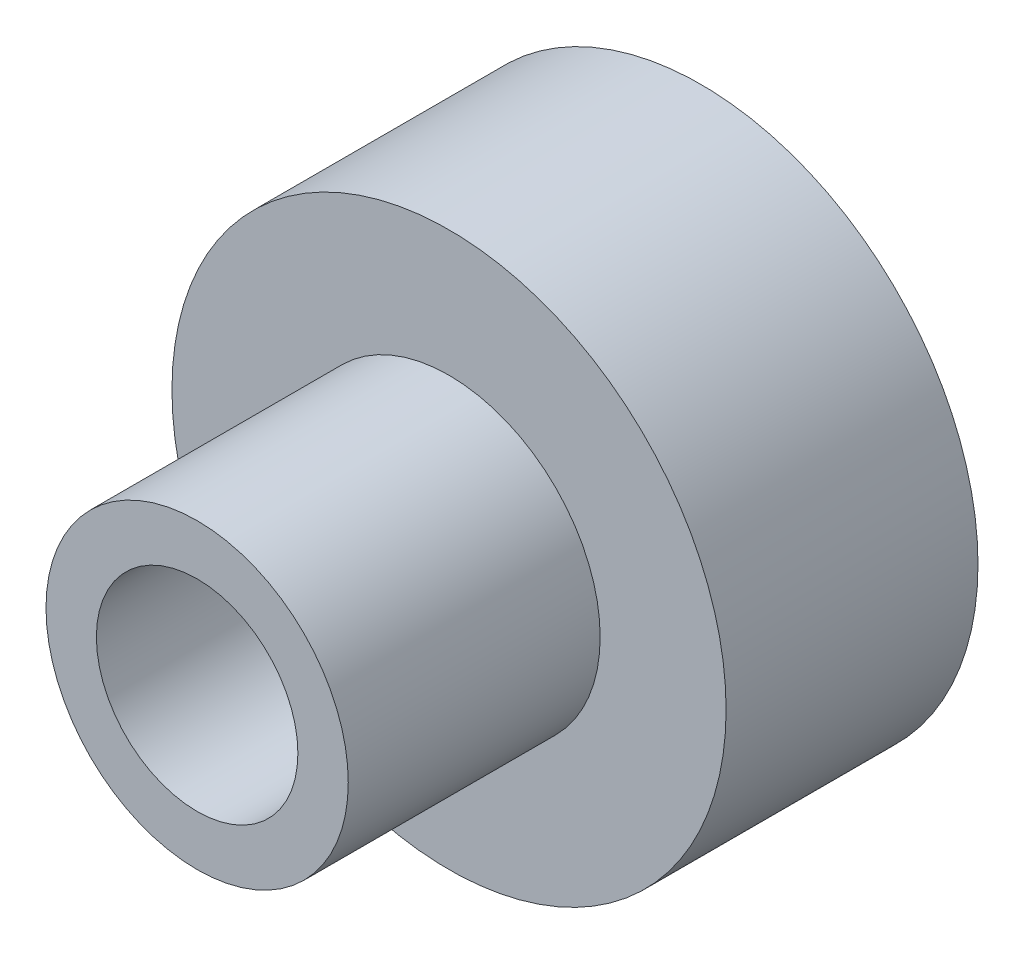
ISO-10303-21;
HEADER;
FILE_DESCRIPTION(('STEP AP214'),'2;1');
FILE_NAME('part.step','',(''),(''),'','','');
FILE_SCHEMA(('AUTOMOTIVE_DESIGN { 1 0 10303 214 1 1 1 1 }'));
ENDSEC;
DATA;
#1=APPLICATION_CONTEXT('core data for automotive mechanical design processes');
#2=APPLICATION_PROTOCOL_DEFINITION('international standard','automotive_design',2000,#1);
#3=PRODUCT_CONTEXT('',#1,'mechanical');
#4=PRODUCT('Part','Part','',(#3));
#5=PRODUCT_RELATED_PRODUCT_CATEGORY('part','',(#4));
#6=PRODUCT_DEFINITION_FORMATION('','',#4);
#7=PRODUCT_DEFINITION_CONTEXT('part definition',#1,'design');
#8=PRODUCT_DEFINITION('design','',#6,#7);
#9=PRODUCT_DEFINITION_SHAPE('','',#8);
#10=(LENGTH_UNIT() NAMED_UNIT(*) SI_UNIT(.MILLI.,.METRE.));
#11=(NAMED_UNIT(*) PLANE_ANGLE_UNIT() SI_UNIT($,.RADIAN.));
#12=(NAMED_UNIT(*) SI_UNIT($,.STERADIAN.) SOLID_ANGLE_UNIT());
#13=UNCERTAINTY_MEASURE_WITH_UNIT(LENGTH_MEASURE(1.E-05),#10,'distance_accuracy_value','');
#14=(GEOMETRIC_REPRESENTATION_CONTEXT(3) GLOBAL_UNCERTAINTY_ASSIGNED_CONTEXT((#13)) GLOBAL_UNIT_ASSIGNED_CONTEXT((#10,
#11,#12)) REPRESENTATION_CONTEXT('',''));
#15=CARTESIAN_POINT('',(0.,0.,0.));
#16=DIRECTION('',(0.,0.,1.));
#17=DIRECTION('',(1.,0.,0.));
#18=AXIS2_PLACEMENT_3D('',#15,#16,#17);
#19=CARTESIAN_POINT('',(0.,0.,-50.));
#20=DIRECTION('',(0.,0.,1.));
#21=DIRECTION('',(1.,0.,0.));
#22=AXIS2_PLACEMENT_3D('',#19,#20,#21);
#23=CYLINDRICAL_SURFACE('',#22,30.);
#24=CARTESIAN_POINT('',(0.,0.,0.));
#25=DIRECTION('',(0.,0.,1.));
#26=DIRECTION('',(1.,0.,0.));
#27=AXIS2_PLACEMENT_3D('',#24,#25,#26);
#28=CIRCLE('',#27,30.);
#29=CARTESIAN_POINT('',(30.,0.,0.));
#30=VERTEX_POINT('',#29);
#31=EDGE_CURVE('E58',#30,#30,#28,.T.);
#32=ORIENTED_EDGE('',*,*,#31,.T.);
#33=EDGE_LOOP('',(#32));
#34=FACE_BOUND('',#33,.T.);
#35=CARTESIAN_POINT('',(0.,0.,-10.));
#36=DIRECTION('',(0.,0.,-1.));
#37=DIRECTION('',(-1.,0.,0.));
#38=AXIS2_PLACEMENT_3D('',#35,#36,#37);
#39=CIRCLE('',#38,30.);
#40=CARTESIAN_POINT('',(-30.,0.,-10.));
#41=VERTEX_POINT('',#40);
#42=EDGE_CURVE('E53',#41,#41,#39,.F.);
#43=ORIENTED_EDGE('',*,*,#42,.F.);
#44=EDGE_LOOP('',(#43));
#45=FACE_BOUND('',#44,.T.);
#46=ADVANCED_FACE('F49',(#34,#45),#23,.F.);
#47=CARTESIAN_POINT('',(0.,0.,-50.));
#48=DIRECTION('',(0.,0.,1.));
#49=DIRECTION('',(1.,0.,0.));
#50=AXIS2_PLACEMENT_3D('',#47,#48,#49);
#51=CYLINDRICAL_SURFACE('',#50,55.);
#52=CARTESIAN_POINT('',(0.,0.,-50.));
#53=DIRECTION('',(0.,0.,1.));
#54=DIRECTION('',(1.,0.,0.));
#55=AXIS2_PLACEMENT_3D('',#52,#53,#54);
#56=CIRCLE('',#55,55.);
#57=CARTESIAN_POINT('',(55.,0.,-50.));
#58=VERTEX_POINT('',#57);
#59=EDGE_CURVE('E11',#58,#58,#56,.T.);
#60=ORIENTED_EDGE('',*,*,#59,.T.);
#61=EDGE_LOOP('',(#60));
#62=FACE_BOUND('',#61,.T.);
#63=CARTESIAN_POINT('',(0.,0.,0.));
#64=DIRECTION('',(0.,0.,1.));
#65=DIRECTION('',(1.,0.,0.));
#66=AXIS2_PLACEMENT_3D('',#63,#64,#65);
#67=CIRCLE('',#66,55.);
#68=CARTESIAN_POINT('',(55.,0.,0.));
#69=VERTEX_POINT('',#68);
#70=EDGE_CURVE('E64',#69,#69,#67,.T.);
#71=ORIENTED_EDGE('',*,*,#70,.F.);
#72=EDGE_LOOP('',(#71));
#73=FACE_BOUND('',#72,.T.);
#74=ADVANCED_FACE('F51',(#62,#73),#51,.T.);
#75=CARTESIAN_POINT('',(0.,0.,-50.));
#76=DIRECTION('',(0.,0.,1.));
#77=DIRECTION('',(1.,0.,0.));
#78=AXIS2_PLACEMENT_3D('',#75,#76,#77);
#79=PLANE('',#78);
#80=CARTESIAN_POINT('',(0.,0.,-50.));
#81=DIRECTION('',(0.,0.,-1.));
#82=DIRECTION('',(-1.,0.,0.));
#83=AXIS2_PLACEMENT_3D('',#80,#81,#82);
#84=CIRCLE('',#83,42.5);
#85=CARTESIAN_POINT('',(-42.5,0.,-50.));
#86=VERTEX_POINT('',#85);
#87=EDGE_CURVE('E67',#86,#86,#84,.T.);
#88=ORIENTED_EDGE('',*,*,#87,.F.);
#89=EDGE_LOOP('',(#88));
#90=FACE_BOUND('',#89,.T.);
#91=ORIENTED_EDGE('',*,*,#59,.F.);
#92=EDGE_LOOP('',(#91));
#93=FACE_BOUND('',#92,.T.);
#94=ADVANCED_FACE('F88',(#90,#93),#79,.F.);
#95=CARTESIAN_POINT('',(0.,0.,0.));
#96=DIRECTION('',(0.,0.,1.));
#97=DIRECTION('',(1.,0.,0.));
#98=AXIS2_PLACEMENT_3D('',#95,#96,#97);
#99=PLANE('',#98);
#100=ORIENTED_EDGE('',*,*,#70,.T.);
#101=EDGE_LOOP('',(#100));
#102=FACE_BOUND('',#101,.T.);
#103=ORIENTED_EDGE('',*,*,#31,.F.);
#104=EDGE_LOOP('',(#103));
#105=FACE_BOUND('',#104,.T.);
#106=ADVANCED_FACE('F91',(#102,#105),#99,.T.);
#107=CARTESIAN_POINT('',(0.,0.,-10.));
#108=DIRECTION('',(0.,0.,-1.));
#109=DIRECTION('',(-1.,0.,0.));
#110=AXIS2_PLACEMENT_3D('',#107,#108,#109);
#111=PLANE('',#110);
#112=CARTESIAN_POINT('',(0.,0.,-10.));
#113=DIRECTION('',(0.,0.,-1.));
#114=DIRECTION('',(-1.,0.,0.));
#115=AXIS2_PLACEMENT_3D('',#112,#113,#114);
#116=CIRCLE('',#115,42.5);
#117=CARTESIAN_POINT('',(-42.5,0.,-10.));
#118=VERTEX_POINT('',#117);
#119=EDGE_CURVE('E75',#118,#118,#116,.T.);
#120=ORIENTED_EDGE('',*,*,#119,.T.);
#121=EDGE_LOOP('',(#120));
#122=FACE_BOUND('',#121,.T.);
#123=ORIENTED_EDGE('',*,*,#42,.T.);
#124=EDGE_LOOP('',(#123));
#125=FACE_BOUND('',#124,.T.);
#126=ADVANCED_FACE('F97',(#122,#125),#111,.T.);
#127=CARTESIAN_POINT('',(0.,0.,-10.));
#128=DIRECTION('',(0.,0.,-1.));
#129=DIRECTION('',(-1.,0.,0.));
#130=AXIS2_PLACEMENT_3D('',#127,#128,#129);
#131=CYLINDRICAL_SURFACE('',#130,42.5);
#132=ORIENTED_EDGE('',*,*,#119,.F.);
#133=EDGE_LOOP('',(#132));
#134=FACE_BOUND('',#133,.T.);
#135=ORIENTED_EDGE('',*,*,#87,.T.);
#136=EDGE_LOOP('',(#135));
#137=FACE_BOUND('',#136,.T.);
#138=ADVANCED_FACE('F86',(#134,#137),#131,.F.);
#139=CLOSED_SHELL('',(#46,#74,#94,#106,#126,#138));
#140=MANIFOLD_SOLID_BREP('B2',#139);
#141=CARTESIAN_POINT('',(0.,0.,50.));
#142=DIRECTION('',(0.,0.,-1.));
#143=DIRECTION('',(-1.,0.,0.));
#144=AXIS2_PLACEMENT_3D('',#141,#142,#143);
#145=CYLINDRICAL_SURFACE('',#144,30.);
#146=CARTESIAN_POINT('',(0.,0.,50.));
#147=DIRECTION('',(0.,0.,1.));
#148=DIRECTION('',(1.,0.,0.));
#149=AXIS2_PLACEMENT_3D('',#146,#147,#148);
#150=CIRCLE('',#149,30.);
#151=CARTESIAN_POINT('',(30.,0.,50.));
#152=VERTEX_POINT('',#151);
#153=EDGE_CURVE('E48',#152,#152,#150,.T.);
#154=ORIENTED_EDGE('',*,*,#153,.F.);
#155=EDGE_LOOP('',(#154));
#156=FACE_BOUND('',#155,.T.);
#157=CARTESIAN_POINT('',(0.,0.,0.));
#158=DIRECTION('',(0.,0.,1.));
#159=DIRECTION('',(1.,0.,0.));
#160=AXIS2_PLACEMENT_3D('',#157,#158,#159);
#161=CIRCLE('',#160,30.);
#162=CARTESIAN_POINT('',(30.,0.,0.));
#163=VERTEX_POINT('',#162);
#164=EDGE_CURVE('E172',#163,#163,#161,.T.);
#165=ORIENTED_EDGE('',*,*,#164,.T.);
#166=EDGE_LOOP('',(#165));
#167=FACE_BOUND('',#166,.T.);
#168=ADVANCED_FACE('F165',(#156,#167),#145,.T.);
#169=CARTESIAN_POINT('',(0.,0.,50.));
#170=DIRECTION('',(0.,0.,1.));
#171=DIRECTION('',(1.,0.,0.));
#172=AXIS2_PLACEMENT_3D('',#169,#170,#171);
#173=PLANE('',#172);
#174=CARTESIAN_POINT('',(0.,0.,50.));
#175=DIRECTION('',(0.,0.,1.));
#176=DIRECTION('',(1.,0.,0.));
#177=AXIS2_PLACEMENT_3D('',#174,#175,#176);
#178=CIRCLE('',#177,20.);
#179=CARTESIAN_POINT('',(20.,0.,50.));
#180=VERTEX_POINT('',#179);
#181=EDGE_CURVE('E178',#180,#180,#178,.T.);
#182=ORIENTED_EDGE('',*,*,#181,.F.);
#183=EDGE_LOOP('',(#182));
#184=FACE_BOUND('',#183,.T.);
#185=ORIENTED_EDGE('',*,*,#153,.T.);
#186=EDGE_LOOP('',(#185));
#187=FACE_BOUND('',#186,.T.);
#188=ADVANCED_FACE('F194',(#184,#187),#173,.T.);
#189=CARTESIAN_POINT('',(0.,0.,0.));
#190=DIRECTION('',(0.,0.,1.));
#191=DIRECTION('',(1.,0.,0.));
#192=AXIS2_PLACEMENT_3D('',#189,#190,#191);
#193=PLANE('',#192);
#194=CARTESIAN_POINT('',(0.,0.,0.));
#195=DIRECTION('',(0.,0.,1.));
#196=DIRECTION('',(1.,0.,0.));
#197=AXIS2_PLACEMENT_3D('',#194,#195,#196);
#198=CIRCLE('',#197,20.);
#199=CARTESIAN_POINT('',(20.,0.,0.));
#200=VERTEX_POINT('',#199);
#201=EDGE_CURVE('E168',#200,#200,#198,.T.);
#202=ORIENTED_EDGE('',*,*,#201,.T.);
#203=EDGE_LOOP('',(#202));
#204=FACE_BOUND('',#203,.T.);
#205=ORIENTED_EDGE('',*,*,#164,.F.);
#206=EDGE_LOOP('',(#205));
#207=FACE_BOUND('',#206,.T.);
#208=ADVANCED_FACE('F185',(#204,#207),#193,.F.);
#209=CARTESIAN_POINT('',(0.,0.,-50.));
#210=DIRECTION('',(0.,0.,1.));
#211=DIRECTION('',(1.,0.,0.));
#212=AXIS2_PLACEMENT_3D('',#209,#210,#211);
#213=CYLINDRICAL_SURFACE('',#212,20.);
#214=ORIENTED_EDGE('',*,*,#181,.T.);
#215=EDGE_LOOP('',(#214));
#216=FACE_BOUND('',#215,.T.);
#217=ORIENTED_EDGE('',*,*,#201,.F.);
#218=EDGE_LOOP('',(#217));
#219=FACE_BOUND('',#218,.T.);
#220=ADVANCED_FACE('F188',(#216,#219),#213,.F.);
#221=CLOSED_SHELL('',(#168,#188,#208,#220));
#222=MANIFOLD_SOLID_BREP('B6',#221);
#223=ADVANCED_BREP_SHAPE_REPRESENTATION('',(#18,#140,#222),#14);
#224=SHAPE_DEFINITION_REPRESENTATION(#9,#223);
ENDSEC;
END-ISO-10303-21;
